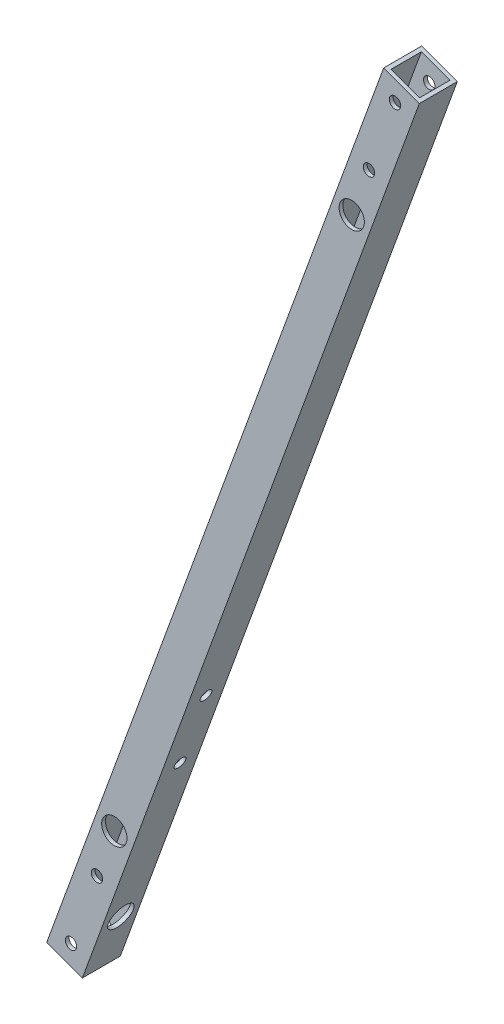
ISO-10303-21;
HEADER;
FILE_DESCRIPTION(('STEP AP214'),'2;1');
FILE_NAME('part.step','',(''),(''),'','','');
FILE_SCHEMA(('AUTOMOTIVE_DESIGN { 1 0 10303 214 1 1 1 1 }'));
ENDSEC;
DATA;
#1=APPLICATION_CONTEXT('core data for automotive mechanical design processes');
#2=APPLICATION_PROTOCOL_DEFINITION('international standard','automotive_design',2000,#1);
#3=PRODUCT_CONTEXT('',#1,'mechanical');
#4=PRODUCT('Part','Part','',(#3));
#5=PRODUCT_RELATED_PRODUCT_CATEGORY('part','',(#4));
#6=PRODUCT_DEFINITION_FORMATION('','',#4);
#7=PRODUCT_DEFINITION_CONTEXT('part definition',#1,'design');
#8=PRODUCT_DEFINITION('design','',#6,#7);
#9=PRODUCT_DEFINITION_SHAPE('','',#8);
#10=(LENGTH_UNIT() NAMED_UNIT(*) SI_UNIT(.MILLI.,.METRE.));
#11=(NAMED_UNIT(*) PLANE_ANGLE_UNIT() SI_UNIT($,.RADIAN.));
#12=(NAMED_UNIT(*) SI_UNIT($,.STERADIAN.) SOLID_ANGLE_UNIT());
#13=UNCERTAINTY_MEASURE_WITH_UNIT(LENGTH_MEASURE(1.E-05),#10,'distance_accuracy_value','');
#14=(GEOMETRIC_REPRESENTATION_CONTEXT(3) GLOBAL_UNCERTAINTY_ASSIGNED_CONTEXT((#13)) GLOBAL_UNIT_ASSIGNED_CONTEXT((#10,
#11,#12)) REPRESENTATION_CONTEXT('',''));
#15=CARTESIAN_POINT('',(0.,0.,0.));
#16=DIRECTION('',(0.,0.,1.));
#17=DIRECTION('',(1.,0.,0.));
#18=AXIS2_PLACEMENT_3D('',#15,#16,#17);
#19=CARTESIAN_POINT('',(-14.0953893117886,5.13030214988498,15.));
#20=DIRECTION('',(0.342020143325665,0.93969262078591,0.));
#21=DIRECTION('',(-0.93969262078591,0.342020143325665,0.));
#22=AXIS2_PLACEMENT_3D('',#19,#20,#21);
#23=PLANE('',#22);
#24=DIRECTION('',(0.93969262078591,-0.342020143325665,0.));
#25=VECTOR('',#24,1.);
#26=CARTESIAN_POINT('',(-14.0953893117886,5.13030214988498,0.));
#27=LINE('',#26,#25);
#28=CARTESIAN_POINT('',(-14.0953893117886,5.13030214988498,0.));
#29=VERTEX_POINT('',#28);
#30=CARTESIAN_POINT('',(0.,0.,0.));
#31=VERTEX_POINT('',#30);
#32=EDGE_CURVE('E146',#29,#31,#27,.T.);
#33=ORIENTED_EDGE('',*,*,#32,.T.);
#34=DIRECTION('',(0.,0.,-1.));
#35=VECTOR('',#34,1.);
#36=CARTESIAN_POINT('',(0.,0.,15.));
#37=LINE('',#36,#35);
#38=CARTESIAN_POINT('',(0.,0.,15.));
#39=VERTEX_POINT('',#38);
#40=EDGE_CURVE('E11',#39,#31,#37,.T.);
#41=ORIENTED_EDGE('',*,*,#40,.F.);
#42=DIRECTION('',(0.93969262078591,-0.342020143325665,0.));
#43=VECTOR('',#42,1.);
#44=CARTESIAN_POINT('',(-14.0953893117886,5.13030214988498,15.));
#45=LINE('',#44,#43);
#46=CARTESIAN_POINT('',(-14.0953893117886,5.13030214988498,15.));
#47=VERTEX_POINT('',#46);
#48=EDGE_CURVE('E155',#47,#39,#45,.T.);
#49=ORIENTED_EDGE('',*,*,#48,.F.);
#50=DIRECTION('',(0.,0.,-1.));
#51=VECTOR('',#50,1.);
#52=CARTESIAN_POINT('',(-14.0953893117886,5.13030214988498,15.));
#53=LINE('',#52,#51);
#54=EDGE_CURVE('E169',#47,#29,#53,.T.);
#55=ORIENTED_EDGE('',*,*,#54,.T.);
#56=EDGE_LOOP('',(#33,#41,#49,#55));
#57=FACE_BOUND('',#56,.T.);
#58=DIRECTION('',(0.93969262078591,-0.342020143325665,0.));
#59=VECTOR('',#58,1.);
#60=CARTESIAN_POINT('',(0.,0.,1.5));
#61=LINE('',#60,#59);
#62=CARTESIAN_POINT('',(-12.6858503806098,4.61727193489649,1.5));
#63=VERTEX_POINT('',#62);
#64=CARTESIAN_POINT('',(-1.40953893117884,0.513030214988488,1.5));
#65=VERTEX_POINT('',#64);
#66=EDGE_CURVE('E114',#63,#65,#61,.T.);
#67=ORIENTED_EDGE('',*,*,#66,.F.);
#68=DIRECTION('',(0.,0.,-1.));
#69=VECTOR('',#68,1.);
#70=CARTESIAN_POINT('',(-12.6858503806098,4.61727193489649,15.));
#71=LINE('',#70,#69);
#72=CARTESIAN_POINT('',(-12.6858503806098,4.61727193489649,13.5));
#73=VERTEX_POINT('',#72);
#74=EDGE_CURVE('E140',#73,#63,#71,.T.);
#75=ORIENTED_EDGE('',*,*,#74,.F.);
#76=DIRECTION('',(0.93969262078591,-0.342020143325665,0.));
#77=VECTOR('',#76,1.);
#78=CARTESIAN_POINT('',(0.,0.,13.5));
#79=LINE('',#78,#77);
#80=CARTESIAN_POINT('',(-1.40953893117884,0.513030214988488,13.5));
#81=VERTEX_POINT('',#80);
#82=EDGE_CURVE('E58',#73,#81,#79,.T.);
#83=ORIENTED_EDGE('',*,*,#82,.T.);
#84=DIRECTION('',(0.,0.,-1.));
#85=VECTOR('',#84,1.);
#86=CARTESIAN_POINT('',(-1.40953893117884,0.513030214988552,15.));
#87=LINE('',#86,#85);
#88=EDGE_CURVE('E126',#81,#65,#87,.T.);
#89=ORIENTED_EDGE('',*,*,#88,.T.);
#90=EDGE_LOOP('',(#67,#75,#83,#89));
#91=FACE_BOUND('',#90,.T.);
#92=ADVANCED_FACE('F41',(#57,#91),#23,.F.);
#93=CARTESIAN_POINT('',(133.115214400364,365.731045750865,15.));
#94=DIRECTION('',(-0.342020143325665,-0.93969262078591,0.));
#95=DIRECTION('',(0.93969262078591,-0.342020143325665,0.));
#96=AXIS2_PLACEMENT_3D('',#93,#94,#95);
#97=PLANE('',#96);
#98=DIRECTION('',(-0.93969262078591,0.342020143325665,0.));
#99=VECTOR('',#98,1.);
#100=CARTESIAN_POINT('',(133.115214400364,365.731045750865,0.));
#101=LINE('',#100,#99);
#102=CARTESIAN_POINT('',(133.115214400364,365.731045750865,0.));
#103=VERTEX_POINT('',#102);
#104=CARTESIAN_POINT('',(119.019825088576,370.86134790075,0.));
#105=VERTEX_POINT('',#104);
#106=EDGE_CURVE('E176',#103,#105,#101,.T.);
#107=ORIENTED_EDGE('',*,*,#106,.T.);
#108=DIRECTION('',(0.,0.,-1.));
#109=VECTOR('',#108,1.);
#110=CARTESIAN_POINT('',(119.019825088576,370.86134790075,15.));
#111=LINE('',#110,#109);
#112=CARTESIAN_POINT('',(119.019825088576,370.86134790075,15.));
#113=VERTEX_POINT('',#112);
#114=EDGE_CURVE('E184',#113,#105,#111,.T.);
#115=ORIENTED_EDGE('',*,*,#114,.F.);
#116=DIRECTION('',(-0.93969262078591,0.342020143325665,0.));
#117=VECTOR('',#116,1.);
#118=CARTESIAN_POINT('',(133.115214400364,365.731045750865,15.));
#119=LINE('',#118,#117);
#120=CARTESIAN_POINT('',(133.115214400364,365.731045750865,15.));
#121=VERTEX_POINT('',#120);
#122=EDGE_CURVE('E163',#121,#113,#119,.T.);
#123=ORIENTED_EDGE('',*,*,#122,.F.);
#124=DIRECTION('',(0.,0.,-1.));
#125=VECTOR('',#124,1.);
#126=CARTESIAN_POINT('',(133.115214400364,365.731045750865,15.));
#127=LINE('',#126,#125);
#128=EDGE_CURVE('E50',#121,#103,#127,.T.);
#129=ORIENTED_EDGE('',*,*,#128,.T.);
#130=EDGE_LOOP('',(#107,#115,#123,#129));
#131=FACE_BOUND('',#130,.T.);
#132=DIRECTION('',(-0.93969262078591,0.342020143325665,0.));
#133=VECTOR('',#132,1.);
#134=CARTESIAN_POINT('',(133.115214400364,365.731045750865,1.5));
#135=LINE('',#134,#133);
#136=CARTESIAN_POINT('',(131.705675469185,366.244075965854,1.5));
#137=VERTEX_POINT('',#136);
#138=CARTESIAN_POINT('',(120.429364019754,370.348317685762,1.5));
#139=VERTEX_POINT('',#138);
#140=EDGE_CURVE('E111',#137,#139,#135,.T.);
#141=ORIENTED_EDGE('',*,*,#140,.F.);
#142=DIRECTION('',(0.,0.,-1.));
#143=VECTOR('',#142,1.);
#144=CARTESIAN_POINT('',(131.705675469185,366.244075965854,15.));
#145=LINE('',#144,#143);
#146=CARTESIAN_POINT('',(131.705675469185,366.244075965854,13.5));
#147=VERTEX_POINT('',#146);
#148=EDGE_CURVE('E121',#147,#137,#145,.T.);
#149=ORIENTED_EDGE('',*,*,#148,.F.);
#150=DIRECTION('',(-0.93969262078591,0.342020143325665,0.));
#151=VECTOR('',#150,1.);
#152=CARTESIAN_POINT('',(133.115214400364,365.731045750865,13.5));
#153=LINE('',#152,#151);
#154=CARTESIAN_POINT('',(120.429364019754,370.348317685762,13.5));
#155=VERTEX_POINT('',#154);
#156=EDGE_CURVE('E63',#147,#155,#153,.T.);
#157=ORIENTED_EDGE('',*,*,#156,.T.);
#158=DIRECTION('',(0.,0.,-1.));
#159=VECTOR('',#158,1.);
#160=CARTESIAN_POINT('',(120.429364019754,370.348317685762,15.));
#161=LINE('',#160,#159);
#162=EDGE_CURVE('E127',#155,#139,#161,.T.);
#163=ORIENTED_EDGE('',*,*,#162,.T.);
#164=EDGE_LOOP('',(#141,#149,#157,#163));
#165=FACE_BOUND('',#164,.T.);
#166=ADVANCED_FACE('F130',(#131,#165),#97,.F.);
#167=CARTESIAN_POINT('',(133.115214400364,365.731045750865,15.));
#168=DIRECTION('',(-0.93969262078591,0.342020143325665,0.));
#169=DIRECTION('',(-0.342020143325665,-0.93969262078591,0.));
#170=AXIS2_PLACEMENT_3D('',#167,#168,#169);
#171=PLANE('',#170);
#172=CARTESIAN_POINT('',(7.69545322482748,21.143083967683,7.5));
#173=DIRECTION('',(0.93969262078591,-0.342020143325666,0.));
#174=DIRECTION('',(0.342020143325666,0.93969262078591,0.));
#175=AXIS2_PLACEMENT_3D('',#172,#173,#174);
#176=CIRCLE('',#175,4.99999999999999);
#177=CARTESIAN_POINT('',(9.4055539414558,25.8415470716125,7.5));
#178=VERTEX_POINT('',#177);
#179=EDGE_CURVE('E440',#178,#178,#176,.T.);
#180=ORIENTED_EDGE('',*,*,#179,.F.);
#181=EDGE_LOOP('',(#180));
#182=FACE_BOUND('',#181,.T.);
#183=CARTESIAN_POINT('',(41.3426140285346,113.587898504628,7.5));
#184=DIRECTION('',(-0.93969262078591,0.342020143325665,0.));
#185=DIRECTION('',(-0.342020143325665,-0.93969262078591,0.));
#186=AXIS2_PLACEMENT_3D('',#183,#184,#185);
#187=CIRCLE('',#186,2.25);
#188=CARTESIAN_POINT('',(40.5730687060519,111.47359010786,7.5));
#189=VERTEX_POINT('',#188);
#190=EDGE_CURVE('E254',#189,#189,#187,.T.);
#191=ORIENTED_EDGE('',*,*,#190,.T.);
#192=EDGE_LOOP('',(#191));
#193=FACE_BOUND('',#192,.T.);
#194=CARTESIAN_POINT('',(31.0820097287646,85.3971198810506,7.5));
#195=DIRECTION('',(-0.93969262078591,0.342020143325665,0.));
#196=DIRECTION('',(-0.342020143325665,-0.93969262078591,0.));
#197=AXIS2_PLACEMENT_3D('',#194,#195,#196);
#198=CIRCLE('',#197,2.25);
#199=CARTESIAN_POINT('',(30.3124644062819,83.2828114842823,7.5));
#200=VERTEX_POINT('',#199);
#201=EDGE_CURVE('E238',#200,#200,#198,.T.);
#202=ORIENTED_EDGE('',*,*,#201,.T.);
#203=EDGE_LOOP('',(#202));
#204=FACE_BOUND('',#203,.T.);
#205=DIRECTION('',(0.342020143325665,0.93969262078591,0.));
#206=VECTOR('',#205,1.);
#207=CARTESIAN_POINT('',(133.115214400364,365.731045750865,0.));
#208=LINE('',#207,#206);
#209=EDGE_CURVE('E173',#31,#103,#208,.T.);
#210=ORIENTED_EDGE('',*,*,#209,.T.);
#211=ORIENTED_EDGE('',*,*,#128,.F.);
#212=DIRECTION('',(0.342020143325665,0.93969262078591,0.));
#213=VECTOR('',#212,1.);
#214=CARTESIAN_POINT('',(133.115214400364,365.731045750865,15.));
#215=LINE('',#214,#213);
#216=EDGE_CURVE('E159',#39,#121,#215,.T.);
#217=ORIENTED_EDGE('',*,*,#216,.F.);
#218=ORIENTED_EDGE('',*,*,#40,.T.);
#219=EDGE_LOOP('',(#210,#211,#217,#218));
#220=FACE_BOUND('',#219,.T.);
#221=ADVANCED_FACE('F316',(#182,#193,#204,#220),#171,.F.);
#222=CARTESIAN_POINT('',(119.019825088576,370.86134790075,15.));
#223=DIRECTION('',(0.93969262078591,-0.342020143325666,0.));
#224=DIRECTION('',(0.342020143325666,0.93969262078591,0.));
#225=AXIS2_PLACEMENT_3D('',#222,#223,#224);
#226=PLANE('',#225);
#227=CARTESIAN_POINT('',(27.2472247167459,118.718200654513,7.5));
#228=DIRECTION('',(-0.93969262078591,0.342020143325665,0.));
#229=DIRECTION('',(-0.342020143325665,-0.93969262078591,0.));
#230=AXIS2_PLACEMENT_3D('',#227,#228,#229);
#231=CIRCLE('',#230,2.25);
#232=CARTESIAN_POINT('',(26.4776793942632,116.603892257745,7.5));
#233=VERTEX_POINT('',#232);
#234=EDGE_CURVE('E229',#233,#233,#231,.T.);
#235=ORIENTED_EDGE('',*,*,#234,.F.);
#236=EDGE_LOOP('',(#235));
#237=FACE_BOUND('',#236,.T.);
#238=CARTESIAN_POINT('',(16.986620416976,90.5274220309356,7.5));
#239=DIRECTION('',(-0.93969262078591,0.342020143325665,0.));
#240=DIRECTION('',(-0.342020143325665,-0.93969262078591,0.));
#241=AXIS2_PLACEMENT_3D('',#238,#239,#240);
#242=CIRCLE('',#241,2.25);
#243=CARTESIAN_POINT('',(16.2170750944932,88.4131136341673,7.5));
#244=VERTEX_POINT('',#243);
#245=EDGE_CURVE('E450',#244,#244,#242,.T.);
#246=ORIENTED_EDGE('',*,*,#245,.F.);
#247=EDGE_LOOP('',(#246));
#248=FACE_BOUND('',#247,.T.);
#249=CARTESIAN_POINT('',(-6.39993608696117,26.273386117568,7.5));
#250=DIRECTION('',(-0.93969262078591,0.342020143325665,0.));
#251=DIRECTION('',(-0.342020143325665,-0.93969262078591,0.));
#252=AXIS2_PLACEMENT_3D('',#249,#250,#251);
#253=CIRCLE('',#252,2.7);
#254=CARTESIAN_POINT('',(-7.32339047394047,23.736216041446,7.5));
#255=VERTEX_POINT('',#254);
#256=EDGE_CURVE('E247',#255,#255,#253,.T.);
#257=ORIENTED_EDGE('',*,*,#256,.F.);
#258=EDGE_LOOP('',(#257));
#259=FACE_BOUND('',#258,.T.);
#260=DIRECTION('',(-0.342020143325666,-0.93969262078591,0.));
#261=VECTOR('',#260,1.);
#262=CARTESIAN_POINT('',(119.019825088576,370.86134790075,0.));
#263=LINE('',#262,#261);
#264=EDGE_CURVE('E160',#105,#29,#263,.T.);
#265=ORIENTED_EDGE('',*,*,#264,.T.);
#266=ORIENTED_EDGE('',*,*,#54,.F.);
#267=DIRECTION('',(-0.342020143325666,-0.93969262078591,0.));
#268=VECTOR('',#267,1.);
#269=CARTESIAN_POINT('',(119.019825088576,370.86134790075,15.));
#270=LINE('',#269,#268);
#271=EDGE_CURVE('E166',#113,#47,#270,.T.);
#272=ORIENTED_EDGE('',*,*,#271,.F.);
#273=ORIENTED_EDGE('',*,*,#114,.T.);
#274=EDGE_LOOP('',(#265,#266,#272,#273));
#275=FACE_BOUND('',#274,.T.);
#276=ADVANCED_FACE('F335',(#237,#248,#259,#275),#226,.F.);
#277=CARTESIAN_POINT('',(0.,0.,15.));
#278=DIRECTION('',(0.,0.,-1.));
#279=DIRECTION('',(-1.,0.,0.));
#280=AXIS2_PLACEMENT_3D('',#277,#278,#279);
#281=PLANE('',#280);
#282=CARTESIAN_POINT('',(106.401361503244,314.263871130618,15.));
#283=DIRECTION('',(0.,0.,1.));
#284=DIRECTION('',(1.,0.,0.));
#285=AXIS2_PLACEMENT_3D('',#282,#283,#284);
#286=CIRCLE('',#285,4.99999999999999);
#287=CARTESIAN_POINT('',(111.401361503244,314.263871130618,15.));
#288=VERTEX_POINT('',#287);
#289=EDGE_CURVE('E425',#288,#288,#286,.T.);
#290=ORIENTED_EDGE('',*,*,#289,.F.);
#291=EDGE_LOOP('',(#290));
#292=FACE_BOUND('',#291,.T.);
#293=CARTESIAN_POINT('',(12.6184635853316,56.5974767701322,15.));
#294=DIRECTION('',(0.,0.,1.));
#295=DIRECTION('',(1.,0.,0.));
#296=AXIS2_PLACEMENT_3D('',#293,#294,#295);
#297=CIRCLE('',#296,4.99999999999999);
#298=CARTESIAN_POINT('',(17.6184635853316,56.5974767701322,15.));
#299=VERTEX_POINT('',#298);
#300=EDGE_CURVE('E430',#299,#299,#297,.T.);
#301=ORIENTED_EDGE('',*,*,#300,.F.);
#302=EDGE_LOOP('',(#301));
#303=FACE_BOUND('',#302,.T.);
#304=CARTESIAN_POINT('',(-4.48254358095182,9.61284573083681,15.));
#305=DIRECTION('',(0.,0.,1.));
#306=DIRECTION('',(1.,0.,0.));
#307=AXIS2_PLACEMENT_3D('',#304,#305,#306);
#308=CIRCLE('',#307,2.25);
#309=CARTESIAN_POINT('',(-2.23254358095182,9.61284573083681,15.));
#310=VERTEX_POINT('',#309);
#311=EDGE_CURVE('E196',#310,#310,#308,.T.);
#312=ORIENTED_EDGE('',*,*,#311,.F.);
#313=EDGE_LOOP('',(#312));
#314=FACE_BOUND('',#313,.T.);
#315=CARTESIAN_POINT('',(123.502368669527,361.248502169914,15.));
#316=DIRECTION('',(0.,0.,1.));
#317=DIRECTION('',(1.,0.,0.));
#318=AXIS2_PLACEMENT_3D('',#315,#316,#317);
#319=CIRCLE('',#318,2.25);
#320=CARTESIAN_POINT('',(125.752368669527,361.248502169914,15.));
#321=VERTEX_POINT('',#320);
#322=EDGE_CURVE('E262',#321,#321,#319,.T.);
#323=ORIENTED_EDGE('',*,*,#322,.F.);
#324=EDGE_LOOP('',(#323));
#325=FACE_BOUND('',#324,.T.);
#326=CARTESIAN_POINT('',(113.241764369757,333.057723546336,15.));
#327=DIRECTION('',(0.,0.,1.));
#328=DIRECTION('',(1.,0.,0.));
#329=AXIS2_PLACEMENT_3D('',#326,#327,#328);
#330=CIRCLE('',#329,2.25);
#331=CARTESIAN_POINT('',(115.491764369758,333.057723546336,15.));
#332=VERTEX_POINT('',#331);
#333=EDGE_CURVE('E266',#332,#332,#330,.T.);
#334=ORIENTED_EDGE('',*,*,#333,.F.);
#335=EDGE_LOOP('',(#334));
#336=FACE_BOUND('',#335,.T.);
#337=CARTESIAN_POINT('',(5.77806071881815,37.8036243544141,15.));
#338=DIRECTION('',(0.,0.,1.));
#339=DIRECTION('',(1.,0.,0.));
#340=AXIS2_PLACEMENT_3D('',#337,#338,#339);
#341=CIRCLE('',#340,2.25);
#342=CARTESIAN_POINT('',(8.02806071881815,37.8036243544141,15.));
#343=VERTEX_POINT('',#342);
#344=EDGE_CURVE('E258',#343,#343,#341,.T.);
#345=ORIENTED_EDGE('',*,*,#344,.F.);
#346=EDGE_LOOP('',(#345));
#347=FACE_BOUND('',#346,.T.);
#348=ORIENTED_EDGE('',*,*,#48,.T.);
#349=ORIENTED_EDGE('',*,*,#216,.T.);
#350=ORIENTED_EDGE('',*,*,#122,.T.);
#351=ORIENTED_EDGE('',*,*,#271,.T.);
#352=EDGE_LOOP('',(#348,#349,#350,#351));
#353=FACE_BOUND('',#352,.T.);
#354=ADVANCED_FACE('F331',(#292,#303,#314,#325,#336,#347,#353),#281,.F.);
#355=CARTESIAN_POINT('',(0.,0.,0.));
#356=DIRECTION('',(0.,0.,-1.));
#357=DIRECTION('',(-1.,0.,0.));
#358=AXIS2_PLACEMENT_3D('',#355,#356,#357);
#359=PLANE('',#358);
#360=CARTESIAN_POINT('',(-4.48254358095182,9.61284573083681,0.));
#361=DIRECTION('',(0.,0.,-1.));
#362=DIRECTION('',(-1.,0.,0.));
#363=AXIS2_PLACEMENT_3D('',#360,#361,#362);
#364=CIRCLE('',#363,2.25);
#365=CARTESIAN_POINT('',(-6.73254358095182,9.61284573083681,0.));
#366=VERTEX_POINT('',#365);
#367=EDGE_CURVE('E154',#366,#366,#364,.T.);
#368=ORIENTED_EDGE('',*,*,#367,.F.);
#369=EDGE_LOOP('',(#368));
#370=FACE_BOUND('',#369,.T.);
#371=CARTESIAN_POINT('',(123.502368669527,361.248502169914,0.));
#372=DIRECTION('',(0.,0.,-1.));
#373=DIRECTION('',(-1.,0.,0.));
#374=AXIS2_PLACEMENT_3D('',#371,#372,#373);
#375=CIRCLE('',#374,2.25);
#376=CARTESIAN_POINT('',(121.252368669527,361.248502169914,0.));
#377=VERTEX_POINT('',#376);
#378=EDGE_CURVE('E224',#377,#377,#375,.T.);
#379=ORIENTED_EDGE('',*,*,#378,.F.);
#380=EDGE_LOOP('',(#379));
#381=FACE_BOUND('',#380,.T.);
#382=CARTESIAN_POINT('',(113.241764369757,333.057723546336,0.));
#383=DIRECTION('',(0.,0.,-1.));
#384=DIRECTION('',(-1.,0.,0.));
#385=AXIS2_PLACEMENT_3D('',#382,#383,#384);
#386=CIRCLE('',#385,2.25);
#387=CARTESIAN_POINT('',(110.991764369757,333.057723546336,0.));
#388=VERTEX_POINT('',#387);
#389=EDGE_CURVE('E218',#388,#388,#386,.T.);
#390=ORIENTED_EDGE('',*,*,#389,.F.);
#391=EDGE_LOOP('',(#390));
#392=FACE_BOUND('',#391,.T.);
#393=CARTESIAN_POINT('',(12.6184635853316,56.5974767701322,0.));
#394=DIRECTION('',(0.,0.,-1.));
#395=DIRECTION('',(-1.,0.,0.));
#396=AXIS2_PLACEMENT_3D('',#393,#394,#395);
#397=CIRCLE('',#396,2.7);
#398=CARTESIAN_POINT('',(9.91846358533157,56.5974767701322,0.));
#399=VERTEX_POINT('',#398);
#400=EDGE_CURVE('E207',#399,#399,#397,.T.);
#401=ORIENTED_EDGE('',*,*,#400,.F.);
#402=EDGE_LOOP('',(#401));
#403=FACE_BOUND('',#402,.T.);
#404=CARTESIAN_POINT('',(106.401361503244,314.263871130618,0.));
#405=DIRECTION('',(0.,0.,-1.));
#406=DIRECTION('',(-1.,0.,0.));
#407=AXIS2_PLACEMENT_3D('',#404,#405,#406);
#408=CIRCLE('',#407,2.69999999999999);
#409=CARTESIAN_POINT('',(103.701361503244,314.263871130618,0.));
#410=VERTEX_POINT('',#409);
#411=EDGE_CURVE('E201',#410,#410,#408,.T.);
#412=ORIENTED_EDGE('',*,*,#411,.F.);
#413=EDGE_LOOP('',(#412));
#414=FACE_BOUND('',#413,.T.);
#415=CARTESIAN_POINT('',(5.77806071881815,37.8036243544141,0.));
#416=DIRECTION('',(0.,0.,-1.));
#417=DIRECTION('',(-1.,0.,0.));
#418=AXIS2_PLACEMENT_3D('',#415,#416,#417);
#419=CIRCLE('',#418,2.25);
#420=CARTESIAN_POINT('',(3.52806071881815,37.8036243544141,0.));
#421=VERTEX_POINT('',#420);
#422=EDGE_CURVE('E202',#421,#421,#419,.T.);
#423=ORIENTED_EDGE('',*,*,#422,.F.);
#424=EDGE_LOOP('',(#423));
#425=FACE_BOUND('',#424,.T.);
#426=ORIENTED_EDGE('',*,*,#32,.F.);
#427=ORIENTED_EDGE('',*,*,#264,.F.);
#428=ORIENTED_EDGE('',*,*,#106,.F.);
#429=ORIENTED_EDGE('',*,*,#209,.F.);
#430=EDGE_LOOP('',(#426,#427,#428,#429));
#431=FACE_BOUND('',#430,.T.);
#432=ADVANCED_FACE('F325',(#370,#381,#392,#403,#414,#425,#431),#359,.T.);
#433=CARTESIAN_POINT('',(131.705675469185,366.244075965854,15.));
#434=DIRECTION('',(-0.93969262078591,0.342020143325665,0.));
#435=DIRECTION('',(-0.342020143325665,-0.93969262078591,0.));
#436=AXIS2_PLACEMENT_3D('',#433,#434,#435);
#437=PLANE('',#436);
#438=CARTESIAN_POINT('',(6.28591429364861,21.6561141826715,7.5));
#439=DIRECTION('',(0.93969262078591,-0.342020143325666,0.));
#440=DIRECTION('',(0.342020143325666,0.93969262078591,0.));
#441=AXIS2_PLACEMENT_3D('',#438,#439,#440);
#442=CIRCLE('',#441,5.);
#443=CARTESIAN_POINT('',(7.99601501027693,26.354577286601,7.5));
#444=VERTEX_POINT('',#443);
#445=EDGE_CURVE('E444',#444,#444,#442,.T.);
#446=ORIENTED_EDGE('',*,*,#445,.T.);
#447=EDGE_LOOP('',(#446));
#448=FACE_BOUND('',#447,.T.);
#449=CARTESIAN_POINT('',(39.9330750973557,114.100928719616,7.5));
#450=DIRECTION('',(-0.93969262078591,0.342020143325665,0.));
#451=DIRECTION('',(-0.342020143325665,-0.93969262078591,0.));
#452=AXIS2_PLACEMENT_3D('',#449,#450,#451);
#453=CIRCLE('',#452,2.25);
#454=CARTESIAN_POINT('',(39.163529774873,111.986620322848,7.5));
#455=VERTEX_POINT('',#454);
#456=EDGE_CURVE('E250',#455,#455,#453,.T.);
#457=ORIENTED_EDGE('',*,*,#456,.F.);
#458=EDGE_LOOP('',(#457));
#459=FACE_BOUND('',#458,.T.);
#460=CARTESIAN_POINT('',(29.6724707975858,85.9101500960391,7.5));
#461=DIRECTION('',(-0.93969262078591,0.342020143325665,0.));
#462=DIRECTION('',(-0.342020143325665,-0.93969262078591,0.));
#463=AXIS2_PLACEMENT_3D('',#460,#461,#462);
#464=CIRCLE('',#463,2.25);
#465=CARTESIAN_POINT('',(28.902925475103,83.7958416992708,7.5));
#466=VERTEX_POINT('',#465);
#467=EDGE_CURVE('E232',#466,#466,#464,.T.);
#468=ORIENTED_EDGE('',*,*,#467,.F.);
#469=EDGE_LOOP('',(#468));
#470=FACE_BOUND('',#469,.T.);
#471=DIRECTION('',(0.342020143325665,0.93969262078591,0.));
#472=VECTOR('',#471,1.);
#473=CARTESIAN_POINT('',(-1.40953893117887,0.513030214988499,1.5));
#474=LINE('',#473,#472);
#475=EDGE_CURVE('E107',#65,#137,#474,.T.);
#476=ORIENTED_EDGE('',*,*,#475,.F.);
#477=ORIENTED_EDGE('',*,*,#88,.F.);
#478=DIRECTION('',(0.342020143325665,0.93969262078591,0.));
#479=VECTOR('',#478,1.);
#480=CARTESIAN_POINT('',(-1.40953893117887,0.513030214988499,13.5));
#481=LINE('',#480,#479);
#482=EDGE_CURVE('E123',#81,#147,#481,.T.);
#483=ORIENTED_EDGE('',*,*,#482,.T.);
#484=ORIENTED_EDGE('',*,*,#148,.T.);
#485=EDGE_LOOP('',(#476,#477,#483,#484));
#486=FACE_BOUND('',#485,.T.);
#487=ADVANCED_FACE('F122',(#448,#459,#470,#486),#437,.T.);
#488=CARTESIAN_POINT('',(120.429364019754,370.348317685762,15.));
#489=DIRECTION('',(0.93969262078591,-0.342020143325666,0.));
#490=DIRECTION('',(0.342020143325666,0.93969262078591,0.));
#491=AXIS2_PLACEMENT_3D('',#488,#489,#490);
#492=PLANE('',#491);
#493=CARTESIAN_POINT('',(28.6567636479248,118.205170439524,7.5));
#494=DIRECTION('',(0.93969262078591,-0.342020143325666,0.));
#495=DIRECTION('',(0.342020143325666,0.93969262078591,0.));
#496=AXIS2_PLACEMENT_3D('',#493,#494,#495);
#497=CIRCLE('',#496,2.25);
#498=CARTESIAN_POINT('',(29.4263089704076,120.319478836293,7.5));
#499=VERTEX_POINT('',#498);
#500=EDGE_CURVE('E44',#499,#499,#497,.T.);
#501=ORIENTED_EDGE('',*,*,#500,.F.);
#502=EDGE_LOOP('',(#501));
#503=FACE_BOUND('',#502,.T.);
#504=CARTESIAN_POINT('',(18.3961593481548,90.0143918159471,7.5));
#505=DIRECTION('',(0.93969262078591,-0.342020143325666,0.));
#506=DIRECTION('',(0.342020143325666,0.93969262078591,0.));
#507=AXIS2_PLACEMENT_3D('',#504,#505,#506);
#508=CIRCLE('',#507,2.25);
#509=CARTESIAN_POINT('',(19.1657046706376,92.1287002127154,7.5));
#510=VERTEX_POINT('',#509);
#511=EDGE_CURVE('E228',#510,#510,#508,.T.);
#512=ORIENTED_EDGE('',*,*,#511,.F.);
#513=EDGE_LOOP('',(#512));
#514=FACE_BOUND('',#513,.T.);
#515=CARTESIAN_POINT('',(-4.99039715578231,25.7603559025795,7.5));
#516=DIRECTION('',(0.93969262078591,-0.342020143325666,0.));
#517=DIRECTION('',(0.342020143325666,0.93969262078591,0.));
#518=AXIS2_PLACEMENT_3D('',#515,#516,#517);
#519=CIRCLE('',#518,2.7);
#520=CARTESIAN_POINT('',(-4.06694276880301,28.2975259787014,7.5));
#521=VERTEX_POINT('',#520);
#522=EDGE_CURVE('E225',#521,#521,#519,.T.);
#523=ORIENTED_EDGE('',*,*,#522,.F.);
#524=EDGE_LOOP('',(#523));
#525=FACE_BOUND('',#524,.T.);
#526=DIRECTION('',(-0.342020143325666,-0.93969262078591,0.));
#527=VECTOR('',#526,1.);
#528=CARTESIAN_POINT('',(-12.6858503806098,4.61727193489648,1.5));
#529=LINE('',#528,#527);
#530=EDGE_CURVE('E132',#139,#63,#529,.T.);
#531=ORIENTED_EDGE('',*,*,#530,.F.);
#532=ORIENTED_EDGE('',*,*,#162,.F.);
#533=DIRECTION('',(-0.342020143325666,-0.93969262078591,0.));
#534=VECTOR('',#533,1.);
#535=CARTESIAN_POINT('',(-12.6858503806098,4.61727193489648,13.5));
#536=LINE('',#535,#534);
#537=EDGE_CURVE('E143',#155,#73,#536,.T.);
#538=ORIENTED_EDGE('',*,*,#537,.T.);
#539=ORIENTED_EDGE('',*,*,#74,.T.);
#540=EDGE_LOOP('',(#531,#532,#538,#539));
#541=FACE_BOUND('',#540,.T.);
#542=ADVANCED_FACE('F309',(#503,#514,#525,#541),#492,.T.);
#543=CARTESIAN_POINT('',(0.,0.,13.5));
#544=DIRECTION('',(0.,0.,-1.));
#545=DIRECTION('',(-1.,0.,0.));
#546=AXIS2_PLACEMENT_3D('',#543,#544,#545);
#547=PLANE('',#546);
#548=CARTESIAN_POINT('',(106.401361503244,314.263871130618,13.5));
#549=DIRECTION('',(0.,0.,1.));
#550=DIRECTION('',(1.,0.,0.));
#551=AXIS2_PLACEMENT_3D('',#548,#549,#550);
#552=CIRCLE('',#551,4.99999999999999);
#553=CARTESIAN_POINT('',(111.401361503244,314.263871130618,13.5));
#554=VERTEX_POINT('',#553);
#555=EDGE_CURVE('E422',#554,#554,#552,.T.);
#556=ORIENTED_EDGE('',*,*,#555,.T.);
#557=EDGE_LOOP('',(#556));
#558=FACE_BOUND('',#557,.T.);
#559=CARTESIAN_POINT('',(12.6184635853316,56.5974767701322,13.5));
#560=DIRECTION('',(0.,0.,1.));
#561=DIRECTION('',(1.,0.,0.));
#562=AXIS2_PLACEMENT_3D('',#559,#560,#561);
#563=CIRCLE('',#562,4.99999999999999);
#564=CARTESIAN_POINT('',(17.6184635853316,56.5974767701322,13.5));
#565=VERTEX_POINT('',#564);
#566=EDGE_CURVE('E436',#565,#565,#563,.T.);
#567=ORIENTED_EDGE('',*,*,#566,.T.);
#568=EDGE_LOOP('',(#567));
#569=FACE_BOUND('',#568,.T.);
#570=CARTESIAN_POINT('',(-4.48254358095182,9.61284573083681,13.5));
#571=DIRECTION('',(0.,0.,-1.));
#572=DIRECTION('',(-1.,0.,0.));
#573=AXIS2_PLACEMENT_3D('',#570,#571,#572);
#574=CIRCLE('',#573,2.25);
#575=CARTESIAN_POINT('',(-6.73254358095182,9.61284573083681,13.5));
#576=VERTEX_POINT('',#575);
#577=EDGE_CURVE('E223',#576,#576,#574,.T.);
#578=ORIENTED_EDGE('',*,*,#577,.F.);
#579=EDGE_LOOP('',(#578));
#580=FACE_BOUND('',#579,.T.);
#581=CARTESIAN_POINT('',(123.502368669527,361.248502169914,13.5));
#582=DIRECTION('',(0.,0.,-1.));
#583=DIRECTION('',(-1.,0.,0.));
#584=AXIS2_PLACEMENT_3D('',#581,#582,#583);
#585=CIRCLE('',#584,2.25);
#586=CARTESIAN_POINT('',(121.252368669527,361.248502169914,13.5));
#587=VERTEX_POINT('',#586);
#588=EDGE_CURVE('E217',#587,#587,#585,.T.);
#589=ORIENTED_EDGE('',*,*,#588,.F.);
#590=EDGE_LOOP('',(#589));
#591=FACE_BOUND('',#590,.T.);
#592=CARTESIAN_POINT('',(113.241764369757,333.057723546336,13.5));
#593=DIRECTION('',(0.,0.,-1.));
#594=DIRECTION('',(-1.,0.,0.));
#595=AXIS2_PLACEMENT_3D('',#592,#593,#594);
#596=CIRCLE('',#595,2.25);
#597=CARTESIAN_POINT('',(110.991764369757,333.057723546336,13.5));
#598=VERTEX_POINT('',#597);
#599=EDGE_CURVE('E212',#598,#598,#596,.T.);
#600=ORIENTED_EDGE('',*,*,#599,.F.);
#601=EDGE_LOOP('',(#600));
#602=FACE_BOUND('',#601,.T.);
#603=CARTESIAN_POINT('',(5.77806071881815,37.8036243544141,13.5));
#604=DIRECTION('',(0.,0.,-1.));
#605=DIRECTION('',(-1.,0.,0.));
#606=AXIS2_PLACEMENT_3D('',#603,#604,#605);
#607=CIRCLE('',#606,2.25);
#608=CARTESIAN_POINT('',(3.52806071881815,37.8036243544141,13.5));
#609=VERTEX_POINT('',#608);
#610=EDGE_CURVE('E195',#609,#609,#607,.T.);
#611=ORIENTED_EDGE('',*,*,#610,.F.);
#612=EDGE_LOOP('',(#611));
#613=FACE_BOUND('',#612,.T.);
#614=ORIENTED_EDGE('',*,*,#82,.F.);
#615=ORIENTED_EDGE('',*,*,#537,.F.);
#616=ORIENTED_EDGE('',*,*,#156,.F.);
#617=ORIENTED_EDGE('',*,*,#482,.F.);
#618=EDGE_LOOP('',(#614,#615,#616,#617));
#619=FACE_BOUND('',#618,.T.);
#620=ADVANCED_FACE('F357',(#558,#569,#580,#591,#602,#613,#619),#547,.T.);
#621=CARTESIAN_POINT('',(0.,0.,1.5));
#622=DIRECTION('',(0.,0.,-1.));
#623=DIRECTION('',(-1.,0.,0.));
#624=AXIS2_PLACEMENT_3D('',#621,#622,#623);
#625=PLANE('',#624);
#626=CARTESIAN_POINT('',(-4.48254358095182,9.61284573083681,1.5));
#627=DIRECTION('',(0.,0.,-1.));
#628=DIRECTION('',(-1.,0.,0.));
#629=AXIS2_PLACEMENT_3D('',#626,#627,#628);
#630=CIRCLE('',#629,2.25);
#631=CARTESIAN_POINT('',(-6.73254358095182,9.61284573083681,1.5));
#632=VERTEX_POINT('',#631);
#633=EDGE_CURVE('E219',#632,#632,#630,.T.);
#634=ORIENTED_EDGE('',*,*,#633,.T.);
#635=EDGE_LOOP('',(#634));
#636=FACE_BOUND('',#635,.T.);
#637=CARTESIAN_POINT('',(123.502368669527,361.248502169914,1.5));
#638=DIRECTION('',(0.,0.,-1.));
#639=DIRECTION('',(-1.,0.,0.));
#640=AXIS2_PLACEMENT_3D('',#637,#638,#639);
#641=CIRCLE('',#640,2.25);
#642=CARTESIAN_POINT('',(121.252368669527,361.248502169914,1.5));
#643=VERTEX_POINT('',#642);
#644=EDGE_CURVE('E213',#643,#643,#641,.T.);
#645=ORIENTED_EDGE('',*,*,#644,.T.);
#646=EDGE_LOOP('',(#645));
#647=FACE_BOUND('',#646,.T.);
#648=CARTESIAN_POINT('',(113.241764369757,333.057723546336,1.5));
#649=DIRECTION('',(0.,0.,-1.));
#650=DIRECTION('',(-1.,0.,0.));
#651=AXIS2_PLACEMENT_3D('',#648,#649,#650);
#652=CIRCLE('',#651,2.25);
#653=CARTESIAN_POINT('',(110.991764369757,333.057723546336,1.5));
#654=VERTEX_POINT('',#653);
#655=EDGE_CURVE('E208',#654,#654,#652,.T.);
#656=ORIENTED_EDGE('',*,*,#655,.T.);
#657=EDGE_LOOP('',(#656));
#658=FACE_BOUND('',#657,.T.);
#659=CARTESIAN_POINT('',(12.6184635853316,56.5974767701322,1.5));
#660=DIRECTION('',(0.,0.,-1.));
#661=DIRECTION('',(-1.,0.,0.));
#662=AXIS2_PLACEMENT_3D('',#659,#660,#661);
#663=CIRCLE('',#662,2.7);
#664=CARTESIAN_POINT('',(9.91846358533157,56.5974767701322,1.5));
#665=VERTEX_POINT('',#664);
#666=EDGE_CURVE('E203',#665,#665,#663,.T.);
#667=ORIENTED_EDGE('',*,*,#666,.T.);
#668=EDGE_LOOP('',(#667));
#669=FACE_BOUND('',#668,.T.);
#670=CARTESIAN_POINT('',(106.401361503244,314.263871130618,1.5));
#671=DIRECTION('',(0.,0.,-1.));
#672=DIRECTION('',(-1.,0.,0.));
#673=AXIS2_PLACEMENT_3D('',#670,#671,#672);
#674=CIRCLE('',#673,2.69999999999999);
#675=CARTESIAN_POINT('',(103.701361503244,314.263871130618,1.5));
#676=VERTEX_POINT('',#675);
#677=EDGE_CURVE('E197',#676,#676,#674,.T.);
#678=ORIENTED_EDGE('',*,*,#677,.T.);
#679=EDGE_LOOP('',(#678));
#680=FACE_BOUND('',#679,.T.);
#681=CARTESIAN_POINT('',(5.77806071881815,37.8036243544141,1.5));
#682=DIRECTION('',(0.,0.,-1.));
#683=DIRECTION('',(-1.,0.,0.));
#684=AXIS2_PLACEMENT_3D('',#681,#682,#683);
#685=CIRCLE('',#684,2.25);
#686=CARTESIAN_POINT('',(3.52806071881815,37.8036243544141,1.5));
#687=VERTEX_POINT('',#686);
#688=EDGE_CURVE('E191',#687,#687,#685,.T.);
#689=ORIENTED_EDGE('',*,*,#688,.T.);
#690=EDGE_LOOP('',(#689));
#691=FACE_BOUND('',#690,.T.);
#692=ORIENTED_EDGE('',*,*,#66,.T.);
#693=ORIENTED_EDGE('',*,*,#475,.T.);
#694=ORIENTED_EDGE('',*,*,#140,.T.);
#695=ORIENTED_EDGE('',*,*,#530,.T.);
#696=EDGE_LOOP('',(#692,#693,#694,#695));
#697=FACE_BOUND('',#696,.T.);
#698=ADVANCED_FACE('F109',(#636,#647,#658,#669,#680,#691,#697),#625,.F.);
#699=CARTESIAN_POINT('',(5.77806071881815,37.8036243544141,-10.));
#700=DIRECTION('',(0.,0.,1.));
#701=DIRECTION('',(1.,0.,0.));
#702=AXIS2_PLACEMENT_3D('',#699,#700,#701);
#703=CYLINDRICAL_SURFACE('',#702,2.25);
#704=ORIENTED_EDGE('',*,*,#422,.T.);
#705=EDGE_LOOP('',(#704));
#706=FACE_BOUND('',#705,.T.);
#707=ORIENTED_EDGE('',*,*,#688,.F.);
#708=EDGE_LOOP('',(#707));
#709=FACE_BOUND('',#708,.T.);
#710=ADVANCED_FACE('F356',(#706,#709),#703,.F.);
#711=CARTESIAN_POINT('',(106.401361503244,314.263871130618,-10.));
#712=DIRECTION('',(0.,0.,1.));
#713=DIRECTION('',(1.,0.,0.));
#714=AXIS2_PLACEMENT_3D('',#711,#712,#713);
#715=CYLINDRICAL_SURFACE('',#714,2.69999999999999);
#716=ORIENTED_EDGE('',*,*,#411,.T.);
#717=EDGE_LOOP('',(#716));
#718=FACE_BOUND('',#717,.T.);
#719=ORIENTED_EDGE('',*,*,#677,.F.);
#720=EDGE_LOOP('',(#719));
#721=FACE_BOUND('',#720,.T.);
#722=ADVANCED_FACE('F373',(#718,#721),#715,.F.);
#723=CARTESIAN_POINT('',(12.6184635853316,56.5974767701322,-10.));
#724=DIRECTION('',(0.,0.,1.));
#725=DIRECTION('',(1.,0.,0.));
#726=AXIS2_PLACEMENT_3D('',#723,#724,#725);
#727=CYLINDRICAL_SURFACE('',#726,2.7);
#728=ORIENTED_EDGE('',*,*,#400,.T.);
#729=EDGE_LOOP('',(#728));
#730=FACE_BOUND('',#729,.T.);
#731=ORIENTED_EDGE('',*,*,#666,.F.);
#732=EDGE_LOOP('',(#731));
#733=FACE_BOUND('',#732,.T.);
#734=ADVANCED_FACE('F376',(#730,#733),#727,.F.);
#735=CARTESIAN_POINT('',(113.241764369757,333.057723546336,-10.));
#736=DIRECTION('',(0.,0.,1.));
#737=DIRECTION('',(1.,0.,0.));
#738=AXIS2_PLACEMENT_3D('',#735,#736,#737);
#739=CYLINDRICAL_SURFACE('',#738,2.25);
#740=ORIENTED_EDGE('',*,*,#389,.T.);
#741=EDGE_LOOP('',(#740));
#742=FACE_BOUND('',#741,.T.);
#743=ORIENTED_EDGE('',*,*,#655,.F.);
#744=EDGE_LOOP('',(#743));
#745=FACE_BOUND('',#744,.T.);
#746=ADVANCED_FACE('F380',(#742,#745),#739,.F.);
#747=CARTESIAN_POINT('',(123.502368669527,361.248502169914,-10.));
#748=DIRECTION('',(0.,0.,1.));
#749=DIRECTION('',(1.,0.,0.));
#750=AXIS2_PLACEMENT_3D('',#747,#748,#749);
#751=CYLINDRICAL_SURFACE('',#750,2.25);
#752=ORIENTED_EDGE('',*,*,#378,.T.);
#753=EDGE_LOOP('',(#752));
#754=FACE_BOUND('',#753,.T.);
#755=ORIENTED_EDGE('',*,*,#644,.F.);
#756=EDGE_LOOP('',(#755));
#757=FACE_BOUND('',#756,.T.);
#758=ADVANCED_FACE('F390',(#754,#757),#751,.F.);
#759=CARTESIAN_POINT('',(-4.48254358095182,9.61284573083681,-10.));
#760=DIRECTION('',(0.,0.,1.));
#761=DIRECTION('',(1.,0.,0.));
#762=AXIS2_PLACEMENT_3D('',#759,#760,#761);
#763=CYLINDRICAL_SURFACE('',#762,2.25);
#764=ORIENTED_EDGE('',*,*,#367,.T.);
#765=EDGE_LOOP('',(#764));
#766=FACE_BOUND('',#765,.T.);
#767=ORIENTED_EDGE('',*,*,#633,.F.);
#768=EDGE_LOOP('',(#767));
#769=FACE_BOUND('',#768,.T.);
#770=ADVANCED_FACE('F371',(#766,#769),#763,.F.);
#771=ORIENTED_EDGE('',*,*,#610,.T.);
#772=EDGE_LOOP('',(#771));
#773=FACE_BOUND('',#772,.T.);
#774=ORIENTED_EDGE('',*,*,#344,.T.);
#775=EDGE_LOOP('',(#774));
#776=FACE_BOUND('',#775,.T.);
#777=ADVANCED_FACE('F367',(#773,#776),#703,.F.);
#778=ORIENTED_EDGE('',*,*,#599,.T.);
#779=EDGE_LOOP('',(#778));
#780=FACE_BOUND('',#779,.T.);
#781=ORIENTED_EDGE('',*,*,#333,.T.);
#782=EDGE_LOOP('',(#781));
#783=FACE_BOUND('',#782,.T.);
#784=ADVANCED_FACE('F370',(#780,#783),#739,.F.);
#785=ORIENTED_EDGE('',*,*,#588,.T.);
#786=EDGE_LOOP('',(#785));
#787=FACE_BOUND('',#786,.T.);
#788=ORIENTED_EDGE('',*,*,#322,.T.);
#789=EDGE_LOOP('',(#788));
#790=FACE_BOUND('',#789,.T.);
#791=ADVANCED_FACE('F384',(#787,#790),#751,.F.);
#792=ORIENTED_EDGE('',*,*,#577,.T.);
#793=EDGE_LOOP('',(#792));
#794=FACE_BOUND('',#793,.T.);
#795=ORIENTED_EDGE('',*,*,#311,.T.);
#796=EDGE_LOOP('',(#795));
#797=FACE_BOUND('',#796,.T.);
#798=ADVANCED_FACE('F388',(#794,#797),#763,.F.);
#799=CARTESIAN_POINT('',(12.393916328757,19.4329832510546,7.5));
#800=DIRECTION('',(-0.93969262078591,0.342020143325665,0.));
#801=DIRECTION('',(-0.342020143325665,-0.93969262078591,0.));
#802=AXIS2_PLACEMENT_3D('',#799,#800,#801);
#803=CYLINDRICAL_SURFACE('',#802,2.7);
#804=ORIENTED_EDGE('',*,*,#522,.T.);
#805=EDGE_LOOP('',(#804));
#806=FACE_BOUND('',#805,.T.);
#807=ORIENTED_EDGE('',*,*,#256,.T.);
#808=EDGE_LOOP('',(#807));
#809=FACE_BOUND('',#808,.T.);
#810=ADVANCED_FACE('F392',(#806,#809),#803,.F.);
#811=CARTESIAN_POINT('',(35.7804728326942,83.6870191644223,7.5));
#812=DIRECTION('',(-0.93969262078591,0.342020143325665,0.));
#813=DIRECTION('',(-0.342020143325665,-0.93969262078591,0.));
#814=AXIS2_PLACEMENT_3D('',#811,#812,#813);
#815=CYLINDRICAL_SURFACE('',#814,2.25);
#816=ORIENTED_EDGE('',*,*,#511,.T.);
#817=EDGE_LOOP('',(#816));
#818=FACE_BOUND('',#817,.T.);
#819=ORIENTED_EDGE('',*,*,#245,.T.);
#820=EDGE_LOOP('',(#819));
#821=FACE_BOUND('',#820,.T.);
#822=ADVANCED_FACE('F396',(#818,#821),#815,.F.);
#823=CARTESIAN_POINT('',(46.0410771324641,111.877797788,7.5));
#824=DIRECTION('',(-0.93969262078591,0.342020143325665,0.));
#825=DIRECTION('',(-0.342020143325665,-0.93969262078591,0.));
#826=AXIS2_PLACEMENT_3D('',#823,#824,#825);
#827=CYLINDRICAL_SURFACE('',#826,2.25);
#828=ORIENTED_EDGE('',*,*,#500,.T.);
#829=EDGE_LOOP('',(#828));
#830=FACE_BOUND('',#829,.T.);
#831=ORIENTED_EDGE('',*,*,#234,.T.);
#832=EDGE_LOOP('',(#831));
#833=FACE_BOUND('',#832,.T.);
#834=ADVANCED_FACE('F400',(#830,#833),#827,.F.);
#835=ORIENTED_EDGE('',*,*,#467,.T.);
#836=EDGE_LOOP('',(#835));
#837=FACE_BOUND('',#836,.T.);
#838=ORIENTED_EDGE('',*,*,#201,.F.);
#839=EDGE_LOOP('',(#838));
#840=FACE_BOUND('',#839,.T.);
#841=ADVANCED_FACE('F401',(#837,#840),#815,.F.);
#842=ORIENTED_EDGE('',*,*,#456,.T.);
#843=EDGE_LOOP('',(#842));
#844=FACE_BOUND('',#843,.T.);
#845=ORIENTED_EDGE('',*,*,#190,.F.);
#846=EDGE_LOOP('',(#845));
#847=FACE_BOUND('',#846,.T.);
#848=ADVANCED_FACE('F405',(#844,#847),#827,.F.);
#849=CARTESIAN_POINT('',(7.69545322482748,21.143083967683,7.5));
#850=DIRECTION('',(0.93969262078591,-0.342020143325666,0.));
#851=DIRECTION('',(0.342020143325666,0.93969262078591,0.));
#852=AXIS2_PLACEMENT_3D('',#849,#850,#851);
#853=CYLINDRICAL_SURFACE('',#852,4.99999999999999);
#854=ORIENTED_EDGE('',*,*,#445,.F.);
#855=EDGE_LOOP('',(#854));
#856=FACE_BOUND('',#855,.T.);
#857=ORIENTED_EDGE('',*,*,#179,.T.);
#858=EDGE_LOOP('',(#857));
#859=FACE_BOUND('',#858,.T.);
#860=ADVANCED_FACE('F406',(#856,#859),#853,.F.);
#861=CARTESIAN_POINT('',(12.6184635853316,56.5974767701322,15.));
#862=DIRECTION('',(0.,0.,1.));
#863=DIRECTION('',(1.,0.,0.));
#864=AXIS2_PLACEMENT_3D('',#861,#862,#863);
#865=CYLINDRICAL_SURFACE('',#864,4.99999999999999);
#866=ORIENTED_EDGE('',*,*,#566,.F.);
#867=EDGE_LOOP('',(#866));
#868=FACE_BOUND('',#867,.T.);
#869=ORIENTED_EDGE('',*,*,#300,.T.);
#870=EDGE_LOOP('',(#869));
#871=FACE_BOUND('',#870,.T.);
#872=ADVANCED_FACE('F409',(#868,#871),#865,.F.);
#873=CARTESIAN_POINT('',(106.401361503244,314.263871130618,15.));
#874=DIRECTION('',(0.,0.,1.));
#875=DIRECTION('',(1.,0.,0.));
#876=AXIS2_PLACEMENT_3D('',#873,#874,#875);
#877=CYLINDRICAL_SURFACE('',#876,4.99999999999999);
#878=ORIENTED_EDGE('',*,*,#555,.F.);
#879=EDGE_LOOP('',(#878));
#880=FACE_BOUND('',#879,.T.);
#881=ORIENTED_EDGE('',*,*,#289,.T.);
#882=EDGE_LOOP('',(#881));
#883=FACE_BOUND('',#882,.T.);
#884=ADVANCED_FACE('F413',(#880,#883),#877,.F.);
#885=CLOSED_SHELL('',(#92,#166,#221,#276,#354,#432,#487,#542,#620,#698,#710,#722,#734,#746,#758,
#770,#777,#784,#791,#798,#810,#822,#834,#841,#848,#860,#872,#884));
#886=MANIFOLD_SOLID_BREP('B2',#885);
#887=ADVANCED_BREP_SHAPE_REPRESENTATION('',(#18,#886),#14);
#888=SHAPE_DEFINITION_REPRESENTATION(#9,#887);
ENDSEC;
END-ISO-10303-21;
